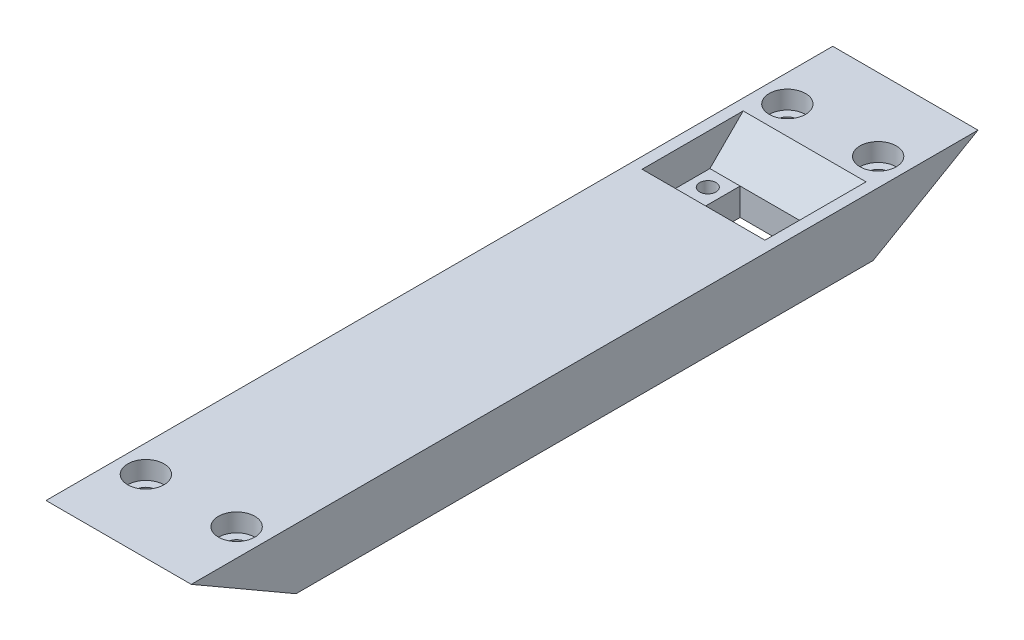
ISO-10303-21;
HEADER;
FILE_DESCRIPTION(('STEP AP214'),'2;1');
FILE_NAME('part.step','',(''),(''),'','','');
FILE_SCHEMA(('AUTOMOTIVE_DESIGN { 1 0 10303 214 1 1 1 1 }'));
ENDSEC;
DATA;
#1=APPLICATION_CONTEXT('core data for automotive mechanical design processes');
#2=APPLICATION_PROTOCOL_DEFINITION('international standard','automotive_design',2000,#1);
#3=PRODUCT_CONTEXT('',#1,'mechanical');
#4=PRODUCT('Part','Part','',(#3));
#5=PRODUCT_RELATED_PRODUCT_CATEGORY('part','',(#4));
#6=PRODUCT_DEFINITION_FORMATION('','',#4);
#7=PRODUCT_DEFINITION_CONTEXT('part definition',#1,'design');
#8=PRODUCT_DEFINITION('design','',#6,#7);
#9=PRODUCT_DEFINITION_SHAPE('','',#8);
#10=(LENGTH_UNIT() NAMED_UNIT(*) SI_UNIT(.MILLI.,.METRE.));
#11=(NAMED_UNIT(*) PLANE_ANGLE_UNIT() SI_UNIT($,.RADIAN.));
#12=(NAMED_UNIT(*) SI_UNIT($,.STERADIAN.) SOLID_ANGLE_UNIT());
#13=UNCERTAINTY_MEASURE_WITH_UNIT(LENGTH_MEASURE(1.E-05),#10,'distance_accuracy_value','');
#14=(GEOMETRIC_REPRESENTATION_CONTEXT(3) GLOBAL_UNCERTAINTY_ASSIGNED_CONTEXT((#13)) GLOBAL_UNIT_ASSIGNED_CONTEXT((#10,
#11,#12)) REPRESENTATION_CONTEXT('',''));
#15=CARTESIAN_POINT('',(0.,0.,0.));
#16=DIRECTION('',(0.,0.,1.));
#17=DIRECTION('',(1.,0.,0.));
#18=AXIS2_PLACEMENT_3D('',#15,#16,#17);
#19=CARTESIAN_POINT('',(7.5,-10.,53.));
#20=DIRECTION('',(0.,1.,0.));
#21=DIRECTION('',(0.,0.,1.));
#22=AXIS2_PLACEMENT_3D('',#19,#20,#21);
#23=CYLINDRICAL_SURFACE('',#22,1.625);
#24=CARTESIAN_POINT('',(7.5,-6.92820323027541,53.));
#25=DIRECTION('',(0.,0.866025403784442,-0.499999999999995));
#26=DIRECTION('',(0.,0.499999999999995,0.866025403784442));
#27=AXIS2_PLACEMENT_3D('',#24,#25,#26);
#28=ELLIPSE('',#27,1.87638837486628,1.625);
#29=CARTESIAN_POINT('',(7.5,-5.99000904284228,54.625));
#30=VERTEX_POINT('',#29);
#31=EDGE_CURVE('E282',#30,#30,#28,.F.);
#32=ORIENTED_EDGE('',*,*,#31,.T.);
#33=EDGE_LOOP('',(#32));
#34=FACE_BOUND('',#33,.T.);
#35=CARTESIAN_POINT('',(7.5,-2.99999999999999,53.));
#36=DIRECTION('',(0.,1.,0.));
#37=DIRECTION('',(0.,0.,1.));
#38=AXIS2_PLACEMENT_3D('',#35,#36,#37);
#39=CIRCLE('',#38,1.625);
#40=CARTESIAN_POINT('',(7.5,-2.99999999999999,54.625));
#41=VERTEX_POINT('',#40);
#42=EDGE_CURVE('E51',#41,#41,#39,.T.);
#43=ORIENTED_EDGE('',*,*,#42,.T.);
#44=EDGE_LOOP('',(#43));
#45=FACE_BOUND('',#44,.T.);
#46=ADVANCED_FACE('F46',(#34,#45),#23,.F.);
#47=CARTESIAN_POINT('',(-7.5,-10.,53.));
#48=DIRECTION('',(0.,1.,0.));
#49=DIRECTION('',(0.,0.,1.));
#50=AXIS2_PLACEMENT_3D('',#47,#48,#49);
#51=CYLINDRICAL_SURFACE('',#50,1.625);
#52=CARTESIAN_POINT('',(-7.5,-6.92820323027541,53.));
#53=DIRECTION('',(0.,0.866025403784442,-0.499999999999995));
#54=DIRECTION('',(0.,0.499999999999995,0.866025403784442));
#55=AXIS2_PLACEMENT_3D('',#52,#53,#54);
#56=ELLIPSE('',#55,1.87638837486628,1.625);
#57=CARTESIAN_POINT('',(-7.5,-5.99000904284228,54.625));
#58=VERTEX_POINT('',#57);
#59=EDGE_CURVE('E286',#58,#58,#56,.F.);
#60=ORIENTED_EDGE('',*,*,#59,.T.);
#61=EDGE_LOOP('',(#60));
#62=FACE_BOUND('',#61,.T.);
#63=CARTESIAN_POINT('',(-7.5,-2.99999999999999,53.));
#64=DIRECTION('',(0.,1.,0.));
#65=DIRECTION('',(0.,0.,1.));
#66=AXIS2_PLACEMENT_3D('',#63,#64,#65);
#67=CIRCLE('',#66,1.625);
#68=CARTESIAN_POINT('',(-7.5,-2.99999999999999,54.625));
#69=VERTEX_POINT('',#68);
#70=EDGE_CURVE('E290',#69,#69,#67,.T.);
#71=ORIENTED_EDGE('',*,*,#70,.T.);
#72=EDGE_LOOP('',(#71));
#73=FACE_BOUND('',#72,.T.);
#74=ADVANCED_FACE('F389',(#62,#73),#51,.F.);
#75=CARTESIAN_POINT('',(7.5,-10.,-53.));
#76=DIRECTION('',(0.,1.,0.));
#77=DIRECTION('',(0.,0.,1.));
#78=AXIS2_PLACEMENT_3D('',#75,#76,#77);
#79=CYLINDRICAL_SURFACE('',#78,1.625);
#80=CARTESIAN_POINT('',(7.5,-6.92820323027539,-53.));
#81=DIRECTION('',(0.,0.866025403784441,0.499999999999995));
#82=DIRECTION('',(0.,0.499999999999995,-0.866025403784442));
#83=AXIS2_PLACEMENT_3D('',#80,#81,#82);
#84=ELLIPSE('',#83,1.87638837486628,1.625);
#85=CARTESIAN_POINT('',(7.5,-5.99000904284226,-54.625));
#86=VERTEX_POINT('',#85);
#87=EDGE_CURVE('E264',#86,#86,#84,.T.);
#88=ORIENTED_EDGE('',*,*,#87,.F.);
#89=EDGE_LOOP('',(#88));
#90=FACE_BOUND('',#89,.T.);
#91=CARTESIAN_POINT('',(7.5,-2.99999999999999,-53.));
#92=DIRECTION('',(0.,1.,0.));
#93=DIRECTION('',(0.,0.,1.));
#94=AXIS2_PLACEMENT_3D('',#91,#92,#93);
#95=CIRCLE('',#94,1.625);
#96=CARTESIAN_POINT('',(7.5,-2.99999999999999,-51.375));
#97=VERTEX_POINT('',#96);
#98=EDGE_CURVE('E269',#97,#97,#95,.F.);
#99=ORIENTED_EDGE('',*,*,#98,.F.);
#100=EDGE_LOOP('',(#99));
#101=FACE_BOUND('',#100,.T.);
#102=ADVANCED_FACE('F396',(#90,#101),#79,.F.);
#103=CARTESIAN_POINT('',(-7.5,-10.,-53.));
#104=DIRECTION('',(0.,1.,0.));
#105=DIRECTION('',(0.,0.,1.));
#106=AXIS2_PLACEMENT_3D('',#103,#104,#105);
#107=CYLINDRICAL_SURFACE('',#106,1.625);
#108=CARTESIAN_POINT('',(-7.5,-6.92820323027539,-53.));
#109=DIRECTION('',(0.,0.866025403784441,0.499999999999995));
#110=DIRECTION('',(0.,0.499999999999995,-0.866025403784442));
#111=AXIS2_PLACEMENT_3D('',#108,#109,#110);
#112=ELLIPSE('',#111,1.87638837486628,1.625);
#113=CARTESIAN_POINT('',(-7.5,-5.99000904284226,-54.625));
#114=VERTEX_POINT('',#113);
#115=EDGE_CURVE('E268',#114,#114,#112,.T.);
#116=ORIENTED_EDGE('',*,*,#115,.F.);
#117=EDGE_LOOP('',(#116));
#118=FACE_BOUND('',#117,.T.);
#119=CARTESIAN_POINT('',(-7.5,-2.99999999999999,-53.));
#120=DIRECTION('',(0.,1.,0.));
#121=DIRECTION('',(0.,0.,1.));
#122=AXIS2_PLACEMENT_3D('',#119,#120,#121);
#123=CIRCLE('',#122,1.625);
#124=CARTESIAN_POINT('',(-7.5,-2.99999999999999,-51.375));
#125=VERTEX_POINT('',#124);
#126=EDGE_CURVE('E274',#125,#125,#123,.F.);
#127=ORIENTED_EDGE('',*,*,#126,.F.);
#128=EDGE_LOOP('',(#127));
#129=FACE_BOUND('',#128,.T.);
#130=ADVANCED_FACE('F419',(#118,#129),#107,.F.);
#131=CARTESIAN_POINT('',(0.,-5.5,0.));
#132=DIRECTION('',(0.,-1.,0.));
#133=DIRECTION('',(0.,0.,-1.));
#134=AXIS2_PLACEMENT_3D('',#131,#132,#133);
#135=PLANE('',#134);
#136=CARTESIAN_POINT('',(7.65000000000001,-5.49999999999999,-40.));
#137=DIRECTION('',(0.,1.,0.));
#138=DIRECTION('',(0.,0.,1.));
#139=AXIS2_PLACEMENT_3D('',#136,#137,#138);
#140=CIRCLE('',#139,1.35);
#141=CARTESIAN_POINT('',(7.65000000000001,-5.49999999999999,-38.65));
#142=VERTEX_POINT('',#141);
#143=EDGE_CURVE('E273',#142,#142,#140,.T.);
#144=ORIENTED_EDGE('',*,*,#143,.F.);
#145=EDGE_LOOP('',(#144));
#146=FACE_BOUND('',#145,.T.);
#147=DIRECTION('',(0.,0.,-1.));
#148=VECTOR('',#147,1.);
#149=CARTESIAN_POINT('',(5.15000000000001,-5.5,0.));
#150=LINE('',#149,#148);
#151=CARTESIAN_POINT('',(5.15000000000001,-5.49999999999999,-37.15));
#152=VERTEX_POINT('',#151);
#153=CARTESIAN_POINT('',(5.15000000000001,-5.49999999999999,-42.85));
#154=VERTEX_POINT('',#153);
#155=EDGE_CURVE('E157',#152,#154,#150,.T.);
#156=ORIENTED_EDGE('',*,*,#155,.F.);
#157=DIRECTION('',(1.,0.,0.));
#158=VECTOR('',#157,1.);
#159=CARTESIAN_POINT('',(-10.15,-5.49999999999999,-37.15));
#160=LINE('',#159,#158);
#161=CARTESIAN_POINT('',(10.15,-5.49999999999999,-37.15));
#162=VERTEX_POINT('',#161);
#163=EDGE_CURVE('E168',#152,#162,#160,.T.);
#164=ORIENTED_EDGE('',*,*,#163,.T.);
#165=DIRECTION('',(0.,0.,-1.));
#166=VECTOR('',#165,1.);
#167=CARTESIAN_POINT('',(10.15,-5.49999999999999,-37.15));
#168=LINE('',#167,#166);
#169=CARTESIAN_POINT('',(10.15,-5.49999999999999,-42.85));
#170=VERTEX_POINT('',#169);
#171=EDGE_CURVE('E355',#162,#170,#168,.T.);
#172=ORIENTED_EDGE('',*,*,#171,.T.);
#173=DIRECTION('',(-1.,0.,0.));
#174=VECTOR('',#173,1.);
#175=CARTESIAN_POINT('',(-10.15,-5.49999999999999,-42.85));
#176=LINE('',#175,#174);
#177=EDGE_CURVE('E171',#170,#154,#176,.T.);
#178=ORIENTED_EDGE('',*,*,#177,.T.);
#179=EDGE_LOOP('',(#156,#164,#172,#178));
#180=FACE_BOUND('',#179,.T.);
#181=ADVANCED_FACE('F166',(#146,#180),#135,.F.);
#182=CARTESIAN_POINT('',(-7.64999999999999,-5.49999999999999,-40.));
#183=DIRECTION('',(0.,1.,0.));
#184=DIRECTION('',(0.,0.,1.));
#185=AXIS2_PLACEMENT_3D('',#182,#183,#184);
#186=CIRCLE('',#185,1.35);
#187=CARTESIAN_POINT('',(-7.64999999999999,-5.49999999999999,-38.65));
#188=VERTEX_POINT('',#187);
#189=EDGE_CURVE('E173',#188,#188,#186,.T.);
#190=ORIENTED_EDGE('',*,*,#189,.F.);
#191=EDGE_LOOP('',(#190));
#192=FACE_BOUND('',#191,.T.);
#193=DIRECTION('',(0.,0.,1.));
#194=VECTOR('',#193,1.);
#195=CARTESIAN_POINT('',(-5.14999999999998,-5.5,0.));
#196=LINE('',#195,#194);
#197=CARTESIAN_POINT('',(-5.14999999999999,-5.49999999999999,-42.85));
#198=VERTEX_POINT('',#197);
#199=CARTESIAN_POINT('',(-5.14999999999999,-5.49999999999999,-37.15));
#200=VERTEX_POINT('',#199);
#201=EDGE_CURVE('E163',#198,#200,#196,.T.);
#202=ORIENTED_EDGE('',*,*,#201,.F.);
#203=CARTESIAN_POINT('',(-10.15,-5.49999999999999,-42.85));
#204=VERTEX_POINT('',#203);
#205=EDGE_CURVE('E357',#198,#204,#176,.T.);
#206=ORIENTED_EDGE('',*,*,#205,.T.);
#207=DIRECTION('',(0.,0.,1.));
#208=VECTOR('',#207,1.);
#209=CARTESIAN_POINT('',(-10.15,-5.49999999999999,-37.15));
#210=LINE('',#209,#208);
#211=CARTESIAN_POINT('',(-10.15,-5.49999999999999,-37.15));
#212=VERTEX_POINT('',#211);
#213=EDGE_CURVE('E182',#204,#212,#210,.T.);
#214=ORIENTED_EDGE('',*,*,#213,.T.);
#215=EDGE_CURVE('E181',#212,#200,#160,.T.);
#216=ORIENTED_EDGE('',*,*,#215,.T.);
#217=EDGE_LOOP('',(#202,#206,#214,#216));
#218=FACE_BOUND('',#217,.T.);
#219=ADVANCED_FACE('F364',(#192,#218),#135,.F.);
#220=CARTESIAN_POINT('',(12.,0.,65.));
#221=DIRECTION('',(0.,-1.,0.));
#222=DIRECTION('',(0.,0.,-1.));
#223=AXIS2_PLACEMENT_3D('',#220,#221,#222);
#224=PLANE('',#223);
#225=CARTESIAN_POINT('',(-7.5,0.,53.));
#226=DIRECTION('',(0.,-1.,0.));
#227=DIRECTION('',(0.,0.,-1.));
#228=AXIS2_PLACEMENT_3D('',#225,#226,#227);
#229=CIRCLE('',#228,3.);
#230=CARTESIAN_POINT('',(-7.5,0.,50.));
#231=VERTEX_POINT('',#230);
#232=EDGE_CURVE('E300',#231,#231,#229,.T.);
#233=ORIENTED_EDGE('',*,*,#232,.T.);
#234=EDGE_LOOP('',(#233));
#235=FACE_BOUND('',#234,.T.);
#236=CARTESIAN_POINT('',(7.5,0.,53.));
#237=DIRECTION('',(0.,-1.,0.));
#238=DIRECTION('',(0.,0.,-1.));
#239=AXIS2_PLACEMENT_3D('',#236,#237,#238);
#240=CIRCLE('',#239,3.);
#241=CARTESIAN_POINT('',(7.5,0.,50.));
#242=VERTEX_POINT('',#241);
#243=EDGE_CURVE('E312',#242,#242,#240,.T.);
#244=ORIENTED_EDGE('',*,*,#243,.T.);
#245=EDGE_LOOP('',(#244));
#246=FACE_BOUND('',#245,.T.);
#247=CARTESIAN_POINT('',(-7.5,0.,-53.));
#248=DIRECTION('',(0.,1.,0.));
#249=DIRECTION('',(0.,0.,1.));
#250=AXIS2_PLACEMENT_3D('',#247,#248,#249);
#251=CIRCLE('',#250,3.);
#252=CARTESIAN_POINT('',(-7.5,0.,-50.));
#253=VERTEX_POINT('',#252);
#254=EDGE_CURVE('E319',#253,#253,#251,.T.);
#255=ORIENTED_EDGE('',*,*,#254,.F.);
#256=EDGE_LOOP('',(#255));
#257=FACE_BOUND('',#256,.T.);
#258=CARTESIAN_POINT('',(7.5,0.,-53.));
#259=DIRECTION('',(0.,1.,0.));
#260=DIRECTION('',(0.,0.,1.));
#261=AXIS2_PLACEMENT_3D('',#258,#259,#260);
#262=CIRCLE('',#261,3.);
#263=CARTESIAN_POINT('',(7.5,0.,-50.));
#264=VERTEX_POINT('',#263);
#265=EDGE_CURVE('E323',#264,#264,#262,.T.);
#266=ORIENTED_EDGE('',*,*,#265,.F.);
#267=EDGE_LOOP('',(#266));
#268=FACE_BOUND('',#267,.T.);
#269=DIRECTION('',(0.,0.,1.));
#270=VECTOR('',#269,1.);
#271=CARTESIAN_POINT('',(-12.,0.,65.));
#272=LINE('',#271,#270);
#273=CARTESIAN_POINT('',(-12.,0.,-65.));
#274=VERTEX_POINT('',#273);
#275=CARTESIAN_POINT('',(-12.,0.,65.));
#276=VERTEX_POINT('',#275);
#277=EDGE_CURVE('E210',#274,#276,#272,.T.);
#278=ORIENTED_EDGE('',*,*,#277,.T.);
#279=DIRECTION('',(-1.,0.,0.));
#280=VECTOR('',#279,1.);
#281=CARTESIAN_POINT('',(12.,0.,65.));
#282=LINE('',#281,#280);
#283=CARTESIAN_POINT('',(12.,0.,65.));
#284=VERTEX_POINT('',#283);
#285=EDGE_CURVE('E225',#284,#276,#282,.T.);
#286=ORIENTED_EDGE('',*,*,#285,.F.);
#287=DIRECTION('',(0.,0.,1.));
#288=VECTOR('',#287,1.);
#289=CARTESIAN_POINT('',(12.,0.,65.));
#290=LINE('',#289,#288);
#291=CARTESIAN_POINT('',(12.,0.,-65.));
#292=VERTEX_POINT('',#291);
#293=EDGE_CURVE('E196',#292,#284,#290,.T.);
#294=ORIENTED_EDGE('',*,*,#293,.F.);
#295=DIRECTION('',(-1.,0.,0.));
#296=VECTOR('',#295,1.);
#297=CARTESIAN_POINT('',(12.,0.,-65.));
#298=LINE('',#297,#296);
#299=EDGE_CURVE('E229',#292,#274,#298,.T.);
#300=ORIENTED_EDGE('',*,*,#299,.T.);
#301=EDGE_LOOP('',(#278,#286,#294,#300));
#302=FACE_BOUND('',#301,.T.);
#303=DIRECTION('',(0.,0.,-1.));
#304=VECTOR('',#303,1.);
#305=CARTESIAN_POINT('',(10.15,0.,65.));
#306=LINE('',#305,#304);
#307=CARTESIAN_POINT('',(10.15,0.,-31.65));
#308=VERTEX_POINT('',#307);
#309=CARTESIAN_POINT('',(10.15,0.,-48.35));
#310=VERTEX_POINT('',#309);
#311=EDGE_CURVE('E65',#308,#310,#306,.T.);
#312=ORIENTED_EDGE('',*,*,#311,.F.);
#313=DIRECTION('',(-1.,0.,0.));
#314=VECTOR('',#313,1.);
#315=CARTESIAN_POINT('',(-10.15,0.,-31.65));
#316=LINE('',#315,#314);
#317=CARTESIAN_POINT('',(-10.15,0.,-31.65));
#318=VERTEX_POINT('',#317);
#319=EDGE_CURVE('E251',#308,#318,#316,.T.);
#320=ORIENTED_EDGE('',*,*,#319,.T.);
#321=DIRECTION('',(0.,0.,1.));
#322=VECTOR('',#321,1.);
#323=CARTESIAN_POINT('',(-10.15,0.,65.));
#324=LINE('',#323,#322);
#325=CARTESIAN_POINT('',(-10.15,0.,-48.35));
#326=VERTEX_POINT('',#325);
#327=EDGE_CURVE('E73',#326,#318,#324,.T.);
#328=ORIENTED_EDGE('',*,*,#327,.F.);
#329=DIRECTION('',(1.,0.,0.));
#330=VECTOR('',#329,1.);
#331=CARTESIAN_POINT('',(10.15,0.,-48.35));
#332=LINE('',#331,#330);
#333=EDGE_CURVE('E150',#326,#310,#332,.T.);
#334=ORIENTED_EDGE('',*,*,#333,.T.);
#335=EDGE_LOOP('',(#312,#320,#328,#334));
#336=FACE_BOUND('',#335,.T.);
#337=ADVANCED_FACE('F370',(#235,#246,#257,#268,#302,#336),#224,.F.);
#338=CARTESIAN_POINT('',(12.,0.,-65.));
#339=DIRECTION('',(0.,0.866025403784441,0.499999999999995));
#340=DIRECTION('',(0.,-0.499999999999995,0.866025403784442));
#341=AXIS2_PLACEMENT_3D('',#338,#339,#340);
#342=PLANE('',#341);
#343=ORIENTED_EDGE('',*,*,#115,.T.);
#344=EDGE_LOOP('',(#343));
#345=FACE_BOUND('',#344,.T.);
#346=ORIENTED_EDGE('',*,*,#87,.T.);
#347=EDGE_LOOP('',(#346));
#348=FACE_BOUND('',#347,.T.);
#349=DIRECTION('',(0.,0.499999999999995,-0.866025403784442));
#350=VECTOR('',#349,1.);
#351=CARTESIAN_POINT('',(-12.,0.,-65.));
#352=LINE('',#351,#350);
#353=CARTESIAN_POINT('',(-12.,-9.99999999999999,-47.679491924311));
#354=VERTEX_POINT('',#353);
#355=EDGE_CURVE('E187',#354,#274,#352,.T.);
#356=ORIENTED_EDGE('',*,*,#355,.T.);
#357=ORIENTED_EDGE('',*,*,#299,.F.);
#358=DIRECTION('',(0.,0.499999999999995,-0.866025403784442));
#359=VECTOR('',#358,1.);
#360=CARTESIAN_POINT('',(12.,0.,-65.));
#361=LINE('',#360,#359);
#362=CARTESIAN_POINT('',(12.,-9.99999999999999,-47.679491924311));
#363=VERTEX_POINT('',#362);
#364=EDGE_CURVE('E192',#363,#292,#361,.T.);
#365=ORIENTED_EDGE('',*,*,#364,.F.);
#366=DIRECTION('',(-1.,0.,0.));
#367=VECTOR('',#366,1.);
#368=CARTESIAN_POINT('',(12.,-9.99999999999999,-47.679491924311));
#369=LINE('',#368,#367);
#370=EDGE_CURVE('E206',#363,#354,#369,.T.);
#371=ORIENTED_EDGE('',*,*,#370,.T.);
#372=EDGE_LOOP('',(#356,#357,#365,#371));
#373=FACE_BOUND('',#372,.T.);
#374=ADVANCED_FACE('F372',(#345,#348,#373),#342,.F.);
#375=CARTESIAN_POINT('',(12.,-10.,47.679491924311));
#376=DIRECTION('',(0.,0.866025403784442,-0.499999999999995));
#377=DIRECTION('',(0.,0.499999999999995,0.866025403784442));
#378=AXIS2_PLACEMENT_3D('',#375,#376,#377);
#379=PLANE('',#378);
#380=ORIENTED_EDGE('',*,*,#59,.F.);
#381=EDGE_LOOP('',(#380));
#382=FACE_BOUND('',#381,.T.);
#383=ORIENTED_EDGE('',*,*,#31,.F.);
#384=EDGE_LOOP('',(#383));
#385=FACE_BOUND('',#384,.T.);
#386=DIRECTION('',(0.,-0.499999999999995,-0.866025403784442));
#387=VECTOR('',#386,1.);
#388=CARTESIAN_POINT('',(-12.,-10.,47.679491924311));
#389=LINE('',#388,#387);
#390=CARTESIAN_POINT('',(-12.,-10.,47.679491924311));
#391=VERTEX_POINT('',#390);
#392=EDGE_CURVE('E213',#276,#391,#389,.T.);
#393=ORIENTED_EDGE('',*,*,#392,.T.);
#394=DIRECTION('',(-1.,0.,0.));
#395=VECTOR('',#394,1.);
#396=CARTESIAN_POINT('',(12.,-10.,47.679491924311));
#397=LINE('',#396,#395);
#398=CARTESIAN_POINT('',(12.,-10.,47.679491924311));
#399=VERTEX_POINT('',#398);
#400=EDGE_CURVE('E221',#399,#391,#397,.T.);
#401=ORIENTED_EDGE('',*,*,#400,.F.);
#402=DIRECTION('',(0.,-0.499999999999995,-0.866025403784442));
#403=VECTOR('',#402,1.);
#404=CARTESIAN_POINT('',(12.,-10.,47.679491924311));
#405=LINE('',#404,#403);
#406=EDGE_CURVE('E200',#284,#399,#405,.T.);
#407=ORIENTED_EDGE('',*,*,#406,.F.);
#408=ORIENTED_EDGE('',*,*,#285,.T.);
#409=EDGE_LOOP('',(#393,#401,#407,#408));
#410=FACE_BOUND('',#409,.T.);
#411=ADVANCED_FACE('F380',(#382,#385,#410),#379,.F.);
#412=CARTESIAN_POINT('',(12.,-9.99999999999999,-47.679491924311));
#413=DIRECTION('',(0.,1.,0.));
#414=DIRECTION('',(0.,0.,1.));
#415=AXIS2_PLACEMENT_3D('',#412,#413,#414);
#416=PLANE('',#415);
#417=CARTESIAN_POINT('',(7.65000000000001,-10.,-40.));
#418=DIRECTION('',(0.,1.,0.));
#419=DIRECTION('',(0.,0.,1.));
#420=AXIS2_PLACEMENT_3D('',#417,#418,#419);
#421=CIRCLE('',#420,1.35);
#422=CARTESIAN_POINT('',(7.65000000000001,-10.,-38.65));
#423=VERTEX_POINT('',#422);
#424=EDGE_CURVE('E351',#423,#423,#421,.T.);
#425=ORIENTED_EDGE('',*,*,#424,.T.);
#426=EDGE_LOOP('',(#425));
#427=FACE_BOUND('',#426,.T.);
#428=CARTESIAN_POINT('',(-7.64999999999999,-10.,-40.));
#429=DIRECTION('',(0.,1.,0.));
#430=DIRECTION('',(0.,0.,1.));
#431=AXIS2_PLACEMENT_3D('',#428,#429,#430);
#432=CIRCLE('',#431,1.35);
#433=CARTESIAN_POINT('',(-7.64999999999999,-10.,-38.65));
#434=VERTEX_POINT('',#433);
#435=EDGE_CURVE('E340',#434,#434,#432,.T.);
#436=ORIENTED_EDGE('',*,*,#435,.T.);
#437=EDGE_LOOP('',(#436));
#438=FACE_BOUND('',#437,.T.);
#439=DIRECTION('',(0.,0.,1.));
#440=VECTOR('',#439,1.);
#441=CARTESIAN_POINT('',(-5.14999999999999,-9.99999999999999,-47.679491924311));
#442=LINE('',#441,#440);
#443=CARTESIAN_POINT('',(-5.14999999999999,-10.,-42.85));
#444=VERTEX_POINT('',#443);
#445=CARTESIAN_POINT('',(-5.14999999999999,-10.,-37.15));
#446=VERTEX_POINT('',#445);
#447=EDGE_CURVE('E243',#444,#446,#442,.T.);
#448=ORIENTED_EDGE('',*,*,#447,.T.);
#449=DIRECTION('',(1.,0.,0.));
#450=VECTOR('',#449,1.);
#451=CARTESIAN_POINT('',(12.,-10.,-37.15));
#452=LINE('',#451,#450);
#453=CARTESIAN_POINT('',(5.15000000000001,-10.,-37.15));
#454=VERTEX_POINT('',#453);
#455=EDGE_CURVE('E151',#446,#454,#452,.T.);
#456=ORIENTED_EDGE('',*,*,#455,.T.);
#457=DIRECTION('',(0.,0.,-1.));
#458=VECTOR('',#457,1.);
#459=CARTESIAN_POINT('',(5.15000000000001,-9.99999999999999,-47.679491924311));
#460=LINE('',#459,#458);
#461=CARTESIAN_POINT('',(5.15000000000001,-10.,-42.85));
#462=VERTEX_POINT('',#461);
#463=EDGE_CURVE('E160',#454,#462,#460,.T.);
#464=ORIENTED_EDGE('',*,*,#463,.T.);
#465=DIRECTION('',(-1.,0.,0.));
#466=VECTOR('',#465,1.);
#467=CARTESIAN_POINT('',(12.,-10.,-42.85));
#468=LINE('',#467,#466);
#469=EDGE_CURVE('E239',#462,#444,#468,.T.);
#470=ORIENTED_EDGE('',*,*,#469,.T.);
#471=EDGE_LOOP('',(#448,#456,#464,#470));
#472=FACE_BOUND('',#471,.T.);
#473=DIRECTION('',(0.,0.,-1.));
#474=VECTOR('',#473,1.);
#475=CARTESIAN_POINT('',(-12.,-9.99999999999999,-47.679491924311));
#476=LINE('',#475,#474);
#477=EDGE_CURVE('E197',#391,#354,#476,.T.);
#478=ORIENTED_EDGE('',*,*,#477,.T.);
#479=ORIENTED_EDGE('',*,*,#370,.F.);
#480=DIRECTION('',(0.,0.,-1.));
#481=VECTOR('',#480,1.);
#482=CARTESIAN_POINT('',(12.,-9.99999999999999,-47.679491924311));
#483=LINE('',#482,#481);
#484=EDGE_CURVE('E203',#399,#363,#483,.T.);
#485=ORIENTED_EDGE('',*,*,#484,.F.);
#486=ORIENTED_EDGE('',*,*,#400,.T.);
#487=EDGE_LOOP('',(#478,#479,#485,#486));
#488=FACE_BOUND('',#487,.T.);
#489=ADVANCED_FACE('F458',(#427,#438,#472,#488),#416,.F.);
#490=CARTESIAN_POINT('',(12.,0.,0.));
#491=DIRECTION('',(-1.,0.,0.));
#492=DIRECTION('',(0.,0.,1.));
#493=AXIS2_PLACEMENT_3D('',#490,#491,#492);
#494=PLANE('',#493);
#495=ORIENTED_EDGE('',*,*,#364,.T.);
#496=ORIENTED_EDGE('',*,*,#293,.T.);
#497=ORIENTED_EDGE('',*,*,#406,.T.);
#498=ORIENTED_EDGE('',*,*,#484,.T.);
#499=EDGE_LOOP('',(#495,#496,#497,#498));
#500=FACE_BOUND('',#499,.T.);
#501=ADVANCED_FACE('F455',(#500),#494,.F.);
#502=CARTESIAN_POINT('',(-12.,0.,0.));
#503=DIRECTION('',(-1.,0.,0.));
#504=DIRECTION('',(0.,0.,1.));
#505=AXIS2_PLACEMENT_3D('',#502,#503,#504);
#506=PLANE('',#505);
#507=ORIENTED_EDGE('',*,*,#355,.F.);
#508=ORIENTED_EDGE('',*,*,#477,.F.);
#509=ORIENTED_EDGE('',*,*,#392,.F.);
#510=ORIENTED_EDGE('',*,*,#277,.F.);
#511=EDGE_LOOP('',(#507,#508,#509,#510));
#512=FACE_BOUND('',#511,.T.);
#513=ADVANCED_FACE('F453',(#512),#506,.T.);
#514=CARTESIAN_POINT('',(10.15,1.20000000068243E-05,-37.15));
#515=DIRECTION('',(-1.,0.,0.));
#516=DIRECTION('',(0.,0.,1.));
#517=AXIS2_PLACEMENT_3D('',#514,#515,#516);
#518=PLANE('',#517);
#519=ORIENTED_EDGE('',*,*,#311,.T.);
#520=DIRECTION('',(0.,-0.707106781186546,0.707106781186549));
#521=VECTOR('',#520,1.);
#522=CARTESIAN_POINT('',(10.15,-5.49999999999998,-42.85));
#523=LINE('',#522,#521);
#524=EDGE_CURVE('E11',#310,#170,#523,.T.);
#525=ORIENTED_EDGE('',*,*,#524,.T.);
#526=ORIENTED_EDGE('',*,*,#171,.F.);
#527=DIRECTION('',(0.,0.707106781186545,0.70710678118655));
#528=VECTOR('',#527,1.);
#529=CARTESIAN_POINT('',(10.15,-5.49999999999999,-37.15));
#530=LINE('',#529,#528);
#531=EDGE_CURVE('E179',#162,#308,#530,.T.);
#532=ORIENTED_EDGE('',*,*,#531,.T.);
#533=EDGE_LOOP('',(#519,#525,#526,#532));
#534=FACE_BOUND('',#533,.T.);
#535=ADVANCED_FACE('F449',(#534),#518,.T.);
#536=CARTESIAN_POINT('',(-10.15,1.20000000078714E-05,-42.85));
#537=DIRECTION('',(0.,0.,1.));
#538=DIRECTION('',(0.,-1.,0.));
#539=AXIS2_PLACEMENT_3D('',#536,#537,#538);
#540=PLANE('',#539);
#541=DIRECTION('',(0.,1.,0.));
#542=VECTOR('',#541,1.);
#543=CARTESIAN_POINT('',(5.15000000000001,-11.,-42.85));
#544=LINE('',#543,#542);
#545=EDGE_CURVE('E162',#462,#154,#544,.T.);
#546=ORIENTED_EDGE('',*,*,#545,.T.);
#547=DIRECTION('',(-1.,0.,0.));
#548=VECTOR('',#547,1.);
#549=CARTESIAN_POINT('',(-10.15,-5.49999999999998,-42.85));
#550=LINE('',#549,#548);
#551=EDGE_CURVE('E254',#154,#198,#550,.T.);
#552=ORIENTED_EDGE('',*,*,#551,.T.);
#553=DIRECTION('',(0.,1.,0.));
#554=VECTOR('',#553,1.);
#555=CARTESIAN_POINT('',(-5.14999999999999,-11.,-42.85));
#556=LINE('',#555,#554);
#557=EDGE_CURVE('E341',#444,#198,#556,.T.);
#558=ORIENTED_EDGE('',*,*,#557,.F.);
#559=ORIENTED_EDGE('',*,*,#469,.F.);
#560=EDGE_LOOP('',(#546,#552,#558,#559));
#561=FACE_BOUND('',#560,.T.);
#562=ADVANCED_FACE('F446',(#561),#540,.T.);
#563=CARTESIAN_POINT('',(-10.15,1.20000000068243E-05,-37.15));
#564=DIRECTION('',(1.,0.,0.));
#565=DIRECTION('',(0.,0.,-1.));
#566=AXIS2_PLACEMENT_3D('',#563,#564,#565);
#567=PLANE('',#566);
#568=ORIENTED_EDGE('',*,*,#327,.T.);
#569=DIRECTION('',(0.,-0.707106781186545,-0.70710678118655));
#570=VECTOR('',#569,1.);
#571=CARTESIAN_POINT('',(-10.15,-5.49999999999999,-37.15));
#572=LINE('',#571,#570);
#573=EDGE_CURVE('E259',#318,#212,#572,.T.);
#574=ORIENTED_EDGE('',*,*,#573,.T.);
#575=ORIENTED_EDGE('',*,*,#213,.F.);
#576=DIRECTION('',(0.,0.707106781186546,-0.707106781186549));
#577=VECTOR('',#576,1.);
#578=CARTESIAN_POINT('',(-10.15,-5.49999999999998,-42.85));
#579=LINE('',#578,#577);
#580=EDGE_CURVE('E57',#204,#326,#579,.T.);
#581=ORIENTED_EDGE('',*,*,#580,.T.);
#582=EDGE_LOOP('',(#568,#574,#575,#581));
#583=FACE_BOUND('',#582,.T.);
#584=ADVANCED_FACE('F367',(#583),#567,.T.);
#585=CARTESIAN_POINT('',(-10.15,1.20000000068243E-05,-37.15));
#586=DIRECTION('',(0.,0.,-1.));
#587=DIRECTION('',(0.,1.,0.));
#588=AXIS2_PLACEMENT_3D('',#585,#586,#587);
#589=PLANE('',#588);
#590=DIRECTION('',(0.,1.,0.));
#591=VECTOR('',#590,1.);
#592=CARTESIAN_POINT('',(-5.14999999999999,-11.,-37.15));
#593=LINE('',#592,#591);
#594=EDGE_CURVE('E144',#446,#200,#593,.T.);
#595=ORIENTED_EDGE('',*,*,#594,.T.);
#596=DIRECTION('',(1.,0.,0.));
#597=VECTOR('',#596,1.);
#598=CARTESIAN_POINT('',(10.15,-5.49999999999999,-37.15));
#599=LINE('',#598,#597);
#600=EDGE_CURVE('E138',#200,#152,#599,.T.);
#601=ORIENTED_EDGE('',*,*,#600,.T.);
#602=DIRECTION('',(0.,1.,0.));
#603=VECTOR('',#602,1.);
#604=CARTESIAN_POINT('',(5.15000000000001,-11.,-37.15));
#605=LINE('',#604,#603);
#606=EDGE_CURVE('E141',#454,#152,#605,.T.);
#607=ORIENTED_EDGE('',*,*,#606,.F.);
#608=ORIENTED_EDGE('',*,*,#455,.F.);
#609=EDGE_LOOP('',(#595,#601,#607,#608));
#610=FACE_BOUND('',#609,.T.);
#611=ADVANCED_FACE('F140',(#610),#589,.T.);
#612=CARTESIAN_POINT('',(-7.64999999999999,-11.,-40.));
#613=DIRECTION('',(0.,1.,0.));
#614=DIRECTION('',(0.,0.,1.));
#615=AXIS2_PLACEMENT_3D('',#612,#613,#614);
#616=CYLINDRICAL_SURFACE('',#615,1.35);
#617=ORIENTED_EDGE('',*,*,#189,.T.);
#618=EDGE_LOOP('',(#617));
#619=FACE_BOUND('',#618,.T.);
#620=ORIENTED_EDGE('',*,*,#435,.F.);
#621=EDGE_LOOP('',(#620));
#622=FACE_BOUND('',#621,.T.);
#623=ADVANCED_FACE('F426',(#619,#622),#616,.F.);
#624=CARTESIAN_POINT('',(7.65000000000001,-11.,-40.));
#625=DIRECTION('',(0.,1.,0.));
#626=DIRECTION('',(0.,0.,1.));
#627=AXIS2_PLACEMENT_3D('',#624,#625,#626);
#628=CYLINDRICAL_SURFACE('',#627,1.35);
#629=ORIENTED_EDGE('',*,*,#143,.T.);
#630=EDGE_LOOP('',(#629));
#631=FACE_BOUND('',#630,.T.);
#632=ORIENTED_EDGE('',*,*,#424,.F.);
#633=EDGE_LOOP('',(#632));
#634=FACE_BOUND('',#633,.T.);
#635=ADVANCED_FACE('F429',(#631,#634),#628,.F.);
#636=CARTESIAN_POINT('',(-5.14999999999998,-11.,0.));
#637=DIRECTION('',(-1.,0.,0.));
#638=DIRECTION('',(0.,0.,1.));
#639=AXIS2_PLACEMENT_3D('',#636,#637,#638);
#640=PLANE('',#639);
#641=ORIENTED_EDGE('',*,*,#557,.T.);
#642=ORIENTED_EDGE('',*,*,#201,.T.);
#643=ORIENTED_EDGE('',*,*,#594,.F.);
#644=ORIENTED_EDGE('',*,*,#447,.F.);
#645=EDGE_LOOP('',(#641,#642,#643,#644));
#646=FACE_BOUND('',#645,.T.);
#647=ADVANCED_FACE('F433',(#646),#640,.F.);
#648=CARTESIAN_POINT('',(5.15000000000001,-11.,0.));
#649=DIRECTION('',(1.,0.,0.));
#650=DIRECTION('',(0.,0.,-1.));
#651=AXIS2_PLACEMENT_3D('',#648,#649,#650);
#652=PLANE('',#651);
#653=ORIENTED_EDGE('',*,*,#606,.T.);
#654=ORIENTED_EDGE('',*,*,#155,.T.);
#655=ORIENTED_EDGE('',*,*,#545,.F.);
#656=ORIENTED_EDGE('',*,*,#463,.F.);
#657=EDGE_LOOP('',(#653,#654,#655,#656));
#658=FACE_BOUND('',#657,.T.);
#659=ADVANCED_FACE('F156',(#658),#652,.F.);
#660=CARTESIAN_POINT('',(-10.15,-5.49999999999999,-37.15));
#661=DIRECTION('',(0.,0.70710678118655,-0.707106781186545));
#662=DIRECTION('',(-1.,0.,0.));
#663=AXIS2_PLACEMENT_3D('',#660,#661,#662);
#664=PLANE('',#663);
#665=ORIENTED_EDGE('',*,*,#573,.F.);
#666=ORIENTED_EDGE('',*,*,#319,.F.);
#667=ORIENTED_EDGE('',*,*,#531,.F.);
#668=ORIENTED_EDGE('',*,*,#163,.F.);
#669=ORIENTED_EDGE('',*,*,#600,.F.);
#670=ORIENTED_EDGE('',*,*,#215,.F.);
#671=EDGE_LOOP('',(#665,#666,#667,#668,#669,#670));
#672=FACE_BOUND('',#671,.T.);
#673=ADVANCED_FACE('F177',(#672),#664,.T.);
#674=CARTESIAN_POINT('',(-10.15,-5.49999999999998,-42.85));
#675=DIRECTION('',(0.,0.707106781186549,0.707106781186546));
#676=DIRECTION('',(1.,0.,0.));
#677=AXIS2_PLACEMENT_3D('',#674,#675,#676);
#678=PLANE('',#677);
#679=ORIENTED_EDGE('',*,*,#524,.F.);
#680=ORIENTED_EDGE('',*,*,#333,.F.);
#681=ORIENTED_EDGE('',*,*,#580,.F.);
#682=ORIENTED_EDGE('',*,*,#205,.F.);
#683=ORIENTED_EDGE('',*,*,#551,.F.);
#684=ORIENTED_EDGE('',*,*,#177,.F.);
#685=EDGE_LOOP('',(#679,#680,#681,#682,#683,#684));
#686=FACE_BOUND('',#685,.T.);
#687=ADVANCED_FACE('F49',(#686),#678,.T.);
#688=CARTESIAN_POINT('',(-7.5,-2.99999999999999,-53.));
#689=DIRECTION('',(0.,1.,0.));
#690=DIRECTION('',(0.,0.,1.));
#691=AXIS2_PLACEMENT_3D('',#688,#689,#690);
#692=PLANE('',#691);
#693=CARTESIAN_POINT('',(-7.5,-2.99999999999999,-53.));
#694=DIRECTION('',(0.,1.,0.));
#695=DIRECTION('',(0.,0.,1.));
#696=AXIS2_PLACEMENT_3D('',#693,#694,#695);
#697=CIRCLE('',#696,3.);
#698=CARTESIAN_POINT('',(-7.5,-2.99999999999999,-50.));
#699=VERTEX_POINT('',#698);
#700=EDGE_CURVE('E278',#699,#699,#697,.T.);
#701=ORIENTED_EDGE('',*,*,#700,.T.);
#702=EDGE_LOOP('',(#701));
#703=FACE_BOUND('',#702,.T.);
#704=ORIENTED_EDGE('',*,*,#126,.T.);
#705=EDGE_LOOP('',(#704));
#706=FACE_BOUND('',#705,.T.);
#707=ADVANCED_FACE('F402',(#703,#706),#692,.T.);
#708=CARTESIAN_POINT('',(-7.5,-2.99999999999999,-53.));
#709=DIRECTION('',(0.,1.,0.));
#710=DIRECTION('',(0.,0.,1.));
#711=AXIS2_PLACEMENT_3D('',#708,#709,#710);
#712=CYLINDRICAL_SURFACE('',#711,3.);
#713=ORIENTED_EDGE('',*,*,#700,.F.);
#714=EDGE_LOOP('',(#713));
#715=FACE_BOUND('',#714,.T.);
#716=ORIENTED_EDGE('',*,*,#254,.T.);
#717=EDGE_LOOP('',(#716));
#718=FACE_BOUND('',#717,.T.);
#719=ADVANCED_FACE('F405',(#715,#718),#712,.F.);
#720=CARTESIAN_POINT('',(7.5,-2.99999999999999,-53.));
#721=DIRECTION('',(0.,1.,0.));
#722=DIRECTION('',(0.,0.,1.));
#723=AXIS2_PLACEMENT_3D('',#720,#721,#722);
#724=PLANE('',#723);
#725=CARTESIAN_POINT('',(7.5,-2.99999999999999,-53.));
#726=DIRECTION('',(0.,1.,0.));
#727=DIRECTION('',(0.,0.,1.));
#728=AXIS2_PLACEMENT_3D('',#725,#726,#727);
#729=CIRCLE('',#728,3.);
#730=CARTESIAN_POINT('',(7.5,-2.99999999999999,-50.));
#731=VERTEX_POINT('',#730);
#732=EDGE_CURVE('E289',#731,#731,#729,.T.);
#733=ORIENTED_EDGE('',*,*,#732,.T.);
#734=EDGE_LOOP('',(#733));
#735=FACE_BOUND('',#734,.T.);
#736=ORIENTED_EDGE('',*,*,#98,.T.);
#737=EDGE_LOOP('',(#736));
#738=FACE_BOUND('',#737,.T.);
#739=ADVANCED_FACE('F409',(#735,#738),#724,.T.);
#740=CARTESIAN_POINT('',(7.5,-2.99999999999999,-53.));
#741=DIRECTION('',(0.,1.,0.));
#742=DIRECTION('',(0.,0.,1.));
#743=AXIS2_PLACEMENT_3D('',#740,#741,#742);
#744=CYLINDRICAL_SURFACE('',#743,3.);
#745=ORIENTED_EDGE('',*,*,#732,.F.);
#746=EDGE_LOOP('',(#745));
#747=FACE_BOUND('',#746,.T.);
#748=ORIENTED_EDGE('',*,*,#265,.T.);
#749=EDGE_LOOP('',(#748));
#750=FACE_BOUND('',#749,.T.);
#751=ADVANCED_FACE('F411',(#747,#750),#744,.F.);
#752=CARTESIAN_POINT('',(-7.5,-2.99999999999999,53.));
#753=DIRECTION('',(0.,1.,0.));
#754=DIRECTION('',(0.,0.,1.));
#755=AXIS2_PLACEMENT_3D('',#752,#753,#754);
#756=CYLINDRICAL_SURFACE('',#755,3.);
#757=CARTESIAN_POINT('',(-7.5,-2.99999999999999,53.));
#758=DIRECTION('',(0.,-1.,0.));
#759=DIRECTION('',(0.,0.,-1.));
#760=AXIS2_PLACEMENT_3D('',#757,#758,#759);
#761=CIRCLE('',#760,3.);
#762=CARTESIAN_POINT('',(-7.5,-2.99999999999999,50.));
#763=VERTEX_POINT('',#762);
#764=EDGE_CURVE('E293',#763,#763,#761,.T.);
#765=ORIENTED_EDGE('',*,*,#764,.T.);
#766=EDGE_LOOP('',(#765));
#767=FACE_BOUND('',#766,.T.);
#768=ORIENTED_EDGE('',*,*,#232,.F.);
#769=EDGE_LOOP('',(#768));
#770=FACE_BOUND('',#769,.T.);
#771=ADVANCED_FACE('F414',(#767,#770),#756,.F.);
#772=CARTESIAN_POINT('',(-7.5,-2.99999999999999,53.));
#773=DIRECTION('',(0.,1.,0.));
#774=DIRECTION('',(0.,0.,-1.));
#775=AXIS2_PLACEMENT_3D('',#772,#773,#774);
#776=PLANE('',#775);
#777=ORIENTED_EDGE('',*,*,#70,.F.);
#778=EDGE_LOOP('',(#777));
#779=FACE_BOUND('',#778,.T.);
#780=ORIENTED_EDGE('',*,*,#764,.F.);
#781=EDGE_LOOP('',(#780));
#782=FACE_BOUND('',#781,.T.);
#783=ADVANCED_FACE('F494',(#779,#782),#776,.T.);
#784=CARTESIAN_POINT('',(7.5,-2.99999999999999,53.));
#785=DIRECTION('',(0.,1.,0.));
#786=DIRECTION('',(0.,0.,1.));
#787=AXIS2_PLACEMENT_3D('',#784,#785,#786);
#788=CYLINDRICAL_SURFACE('',#787,3.);
#789=CARTESIAN_POINT('',(7.5,-2.99999999999999,53.));
#790=DIRECTION('',(0.,-1.,0.));
#791=DIRECTION('',(0.,0.,-1.));
#792=AXIS2_PLACEMENT_3D('',#789,#790,#791);
#793=CIRCLE('',#792,3.);
#794=CARTESIAN_POINT('',(7.5,-2.99999999999999,50.));
#795=VERTEX_POINT('',#794);
#796=EDGE_CURVE('E306',#795,#795,#793,.T.);
#797=ORIENTED_EDGE('',*,*,#796,.T.);
#798=EDGE_LOOP('',(#797));
#799=FACE_BOUND('',#798,.T.);
#800=ORIENTED_EDGE('',*,*,#243,.F.);
#801=EDGE_LOOP('',(#800));
#802=FACE_BOUND('',#801,.T.);
#803=ADVANCED_FACE('F507',(#799,#802),#788,.F.);
#804=CARTESIAN_POINT('',(7.5,-2.99999999999999,53.));
#805=DIRECTION('',(0.,1.,0.));
#806=DIRECTION('',(0.,0.,-1.));
#807=AXIS2_PLACEMENT_3D('',#804,#805,#806);
#808=PLANE('',#807);
#809=ORIENTED_EDGE('',*,*,#42,.F.);
#810=EDGE_LOOP('',(#809));
#811=FACE_BOUND('',#810,.T.);
#812=ORIENTED_EDGE('',*,*,#796,.F.);
#813=EDGE_LOOP('',(#812));
#814=FACE_BOUND('',#813,.T.);
#815=ADVANCED_FACE('F519',(#811,#814),#808,.T.);
#816=CLOSED_SHELL('',(#46,#74,#102,#130,#181,#219,#337,#374,#411,#489,#501,#513,#535,#562,#584,
#611,#623,#635,#647,#659,#673,#687,#707,#719,#739,#751,#771,#783,#803,#815));
#817=MANIFOLD_SOLID_BREP('B2',#816);
#818=ADVANCED_BREP_SHAPE_REPRESENTATION('',(#18,#817),#14);
#819=SHAPE_DEFINITION_REPRESENTATION(#9,#818);
ENDSEC;
END-ISO-10303-21;
